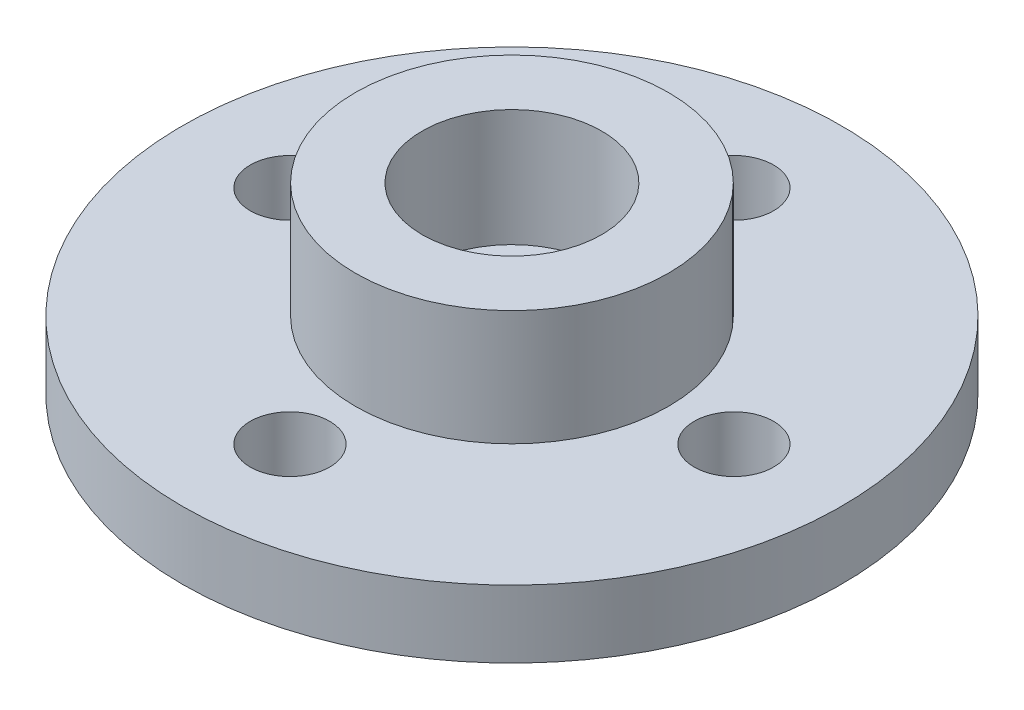
ISO-10303-21;
HEADER;
FILE_DESCRIPTION(('STEP AP214'),'2;1');
FILE_NAME('part.step','',(''),(''),'','','');
FILE_SCHEMA(('AUTOMOTIVE_DESIGN { 1 0 10303 214 1 1 1 1 }'));
ENDSEC;
DATA;
#1=APPLICATION_CONTEXT('core data for automotive mechanical design processes');
#2=APPLICATION_PROTOCOL_DEFINITION('international standard','automotive_design',2000,#1);
#3=PRODUCT_CONTEXT('',#1,'mechanical');
#4=PRODUCT('Part','Part','',(#3));
#5=PRODUCT_RELATED_PRODUCT_CATEGORY('part','',(#4));
#6=PRODUCT_DEFINITION_FORMATION('','',#4);
#7=PRODUCT_DEFINITION_CONTEXT('part definition',#1,'design');
#8=PRODUCT_DEFINITION('design','',#6,#7);
#9=PRODUCT_DEFINITION_SHAPE('','',#8);
#10=(LENGTH_UNIT() NAMED_UNIT(*) SI_UNIT(.MILLI.,.METRE.));
#11=(NAMED_UNIT(*) PLANE_ANGLE_UNIT() SI_UNIT($,.RADIAN.));
#12=(NAMED_UNIT(*) SI_UNIT($,.STERADIAN.) SOLID_ANGLE_UNIT());
#13=UNCERTAINTY_MEASURE_WITH_UNIT(LENGTH_MEASURE(1.E-05),#10,'distance_accuracy_value','');
#14=(GEOMETRIC_REPRESENTATION_CONTEXT(3) GLOBAL_UNCERTAINTY_ASSIGNED_CONTEXT((#13)) GLOBAL_UNIT_ASSIGNED_CONTEXT((#10,
#11,#12)) REPRESENTATION_CONTEXT('',''));
#15=CARTESIAN_POINT('',(0.,0.,0.));
#16=DIRECTION('',(0.,0.,1.));
#17=DIRECTION('',(1.,0.,0.));
#18=AXIS2_PLACEMENT_3D('',#15,#16,#17);
#19=CARTESIAN_POINT('',(0.,2.05,0.));
#20=DIRECTION('',(0.,-1.,0.));
#21=DIRECTION('',(0.,0.,-1.));
#22=AXIS2_PLACEMENT_3D('',#19,#20,#21);
#23=CYLINDRICAL_SURFACE('',#22,10.);
#24=CARTESIAN_POINT('',(0.,2.05,0.));
#25=DIRECTION('',(0.,1.,0.));
#26=DIRECTION('',(0.,0.,1.));
#27=AXIS2_PLACEMENT_3D('',#24,#25,#26);
#28=CIRCLE('',#27,10.);
#29=CARTESIAN_POINT('',(0.,2.05,10.));
#30=VERTEX_POINT('',#29);
#31=EDGE_CURVE('E10',#30,#30,#28,.T.);
#32=ORIENTED_EDGE('',*,*,#31,.F.);
#33=EDGE_LOOP('',(#32));
#34=FACE_BOUND('',#33,.T.);
#35=CARTESIAN_POINT('',(0.,0.,0.));
#36=DIRECTION('',(0.,1.,0.));
#37=DIRECTION('',(0.,0.,1.));
#38=AXIS2_PLACEMENT_3D('',#35,#36,#37);
#39=CIRCLE('',#38,10.);
#40=CARTESIAN_POINT('',(0.,0.,10.));
#41=VERTEX_POINT('',#40);
#42=EDGE_CURVE('E33',#41,#41,#39,.T.);
#43=ORIENTED_EDGE('',*,*,#42,.T.);
#44=EDGE_LOOP('',(#43));
#45=FACE_BOUND('',#44,.T.);
#46=ADVANCED_FACE('F30',(#34,#45),#23,.T.);
#47=CARTESIAN_POINT('',(0.,2.05,0.));
#48=DIRECTION('',(0.,1.,0.));
#49=DIRECTION('',(0.,0.,1.));
#50=AXIS2_PLACEMENT_3D('',#47,#48,#49);
#51=PLANE('',#50);
#52=CARTESIAN_POINT('',(6.735,2.05,0.));
#53=DIRECTION('',(0.,1.,0.));
#54=DIRECTION('',(0.,0.,1.));
#55=AXIS2_PLACEMENT_3D('',#52,#53,#54);
#56=CIRCLE('',#55,1.205);
#57=CARTESIAN_POINT('',(6.735,2.05,1.205));
#58=VERTEX_POINT('',#57);
#59=EDGE_CURVE('E71',#58,#58,#56,.T.);
#60=ORIENTED_EDGE('',*,*,#59,.F.);
#61=EDGE_LOOP('',(#60));
#62=FACE_BOUND('',#61,.T.);
#63=CARTESIAN_POINT('',(0.,2.05,-6.735));
#64=DIRECTION('',(0.,1.,0.));
#65=DIRECTION('',(0.,0.,1.));
#66=AXIS2_PLACEMENT_3D('',#63,#64,#65);
#67=CIRCLE('',#66,1.205);
#68=CARTESIAN_POINT('',(0.,2.05,-5.53));
#69=VERTEX_POINT('',#68);
#70=EDGE_CURVE('E74',#69,#69,#67,.T.);
#71=ORIENTED_EDGE('',*,*,#70,.F.);
#72=EDGE_LOOP('',(#71));
#73=FACE_BOUND('',#72,.T.);
#74=CARTESIAN_POINT('',(0.,2.05,6.735));
#75=DIRECTION('',(0.,1.,0.));
#76=DIRECTION('',(0.,0.,1.));
#77=AXIS2_PLACEMENT_3D('',#74,#75,#76);
#78=CIRCLE('',#77,1.205);
#79=CARTESIAN_POINT('',(0.,2.05,7.94));
#80=VERTEX_POINT('',#79);
#81=EDGE_CURVE('E65',#80,#80,#78,.T.);
#82=ORIENTED_EDGE('',*,*,#81,.F.);
#83=EDGE_LOOP('',(#82));
#84=FACE_BOUND('',#83,.T.);
#85=CARTESIAN_POINT('',(-6.735,2.05,0.));
#86=DIRECTION('',(0.,1.,0.));
#87=DIRECTION('',(0.,0.,1.));
#88=AXIS2_PLACEMENT_3D('',#85,#86,#87);
#89=CIRCLE('',#88,1.205);
#90=CARTESIAN_POINT('',(-6.735,2.05,1.205));
#91=VERTEX_POINT('',#90);
#92=EDGE_CURVE('E59',#91,#91,#89,.T.);
#93=ORIENTED_EDGE('',*,*,#92,.F.);
#94=EDGE_LOOP('',(#93));
#95=FACE_BOUND('',#94,.T.);
#96=CARTESIAN_POINT('',(0.,2.05,0.));
#97=DIRECTION('',(0.,1.,0.));
#98=DIRECTION('',(0.,0.,1.));
#99=AXIS2_PLACEMENT_3D('',#96,#97,#98);
#100=CIRCLE('',#99,4.75);
#101=CARTESIAN_POINT('',(0.,2.05,4.75));
#102=VERTEX_POINT('',#101);
#103=EDGE_CURVE('E42',#102,#102,#100,.T.);
#104=ORIENTED_EDGE('',*,*,#103,.F.);
#105=EDGE_LOOP('',(#104));
#106=FACE_BOUND('',#105,.T.);
#107=ORIENTED_EDGE('',*,*,#31,.T.);
#108=EDGE_LOOP('',(#107));
#109=FACE_BOUND('',#108,.T.);
#110=ADVANCED_FACE('F90',(#62,#73,#84,#95,#106,#109),#51,.T.);
#111=CARTESIAN_POINT('',(0.,0.,0.));
#112=DIRECTION('',(0.,1.,0.));
#113=DIRECTION('',(0.,0.,1.));
#114=AXIS2_PLACEMENT_3D('',#111,#112,#113);
#115=PLANE('',#114);
#116=CARTESIAN_POINT('',(6.735,0.,0.));
#117=DIRECTION('',(0.,-1.,0.));
#118=DIRECTION('',(0.,0.,1.));
#119=AXIS2_PLACEMENT_3D('',#116,#117,#118);
#120=CIRCLE('',#119,1.205);
#121=CARTESIAN_POINT('',(6.735,0.,1.205));
#122=VERTEX_POINT('',#121);
#123=EDGE_CURVE('E77',#122,#122,#120,.T.);
#124=ORIENTED_EDGE('',*,*,#123,.F.);
#125=EDGE_LOOP('',(#124));
#126=FACE_BOUND('',#125,.T.);
#127=CARTESIAN_POINT('',(0.,0.,-6.735));
#128=DIRECTION('',(0.,-1.,0.));
#129=DIRECTION('',(1.,0.,0.));
#130=AXIS2_PLACEMENT_3D('',#127,#128,#129);
#131=CIRCLE('',#130,1.205);
#132=CARTESIAN_POINT('',(1.20499999999993,0.,-6.73500000000001));
#133=VERTEX_POINT('',#132);
#134=EDGE_CURVE('E78',#133,#133,#131,.T.);
#135=ORIENTED_EDGE('',*,*,#134,.F.);
#136=EDGE_LOOP('',(#135));
#137=FACE_BOUND('',#136,.T.);
#138=CARTESIAN_POINT('',(0.,0.,6.735));
#139=DIRECTION('',(0.,-1.,0.));
#140=DIRECTION('',(-1.,0.,0.));
#141=AXIS2_PLACEMENT_3D('',#138,#139,#140);
#142=CIRCLE('',#141,1.205);
#143=CARTESIAN_POINT('',(-1.20499999999998,0.,6.735));
#144=VERTEX_POINT('',#143);
#145=EDGE_CURVE('E68',#144,#144,#142,.T.);
#146=ORIENTED_EDGE('',*,*,#145,.F.);
#147=EDGE_LOOP('',(#146));
#148=FACE_BOUND('',#147,.T.);
#149=CARTESIAN_POINT('',(-6.735,0.,0.));
#150=DIRECTION('',(0.,-1.,0.));
#151=DIRECTION('',(0.,0.,-1.));
#152=AXIS2_PLACEMENT_3D('',#149,#150,#151);
#153=CIRCLE('',#152,1.205);
#154=CARTESIAN_POINT('',(-6.735,0.,-1.205));
#155=VERTEX_POINT('',#154);
#156=EDGE_CURVE('E62',#155,#155,#153,.T.);
#157=ORIENTED_EDGE('',*,*,#156,.F.);
#158=EDGE_LOOP('',(#157));
#159=FACE_BOUND('',#158,.T.);
#160=CARTESIAN_POINT('',(0.,0.,0.));
#161=DIRECTION('',(0.,1.,0.));
#162=DIRECTION('',(0.,0.,1.));
#163=AXIS2_PLACEMENT_3D('',#160,#161,#162);
#164=CIRCLE('',#163,1.375);
#165=CARTESIAN_POINT('',(0.,0.,1.375));
#166=VERTEX_POINT('',#165);
#167=EDGE_CURVE('E51',#166,#166,#164,.T.);
#168=ORIENTED_EDGE('',*,*,#167,.T.);
#169=EDGE_LOOP('',(#168));
#170=FACE_BOUND('',#169,.T.);
#171=ORIENTED_EDGE('',*,*,#42,.F.);
#172=EDGE_LOOP('',(#171));
#173=FACE_BOUND('',#172,.T.);
#174=ADVANCED_FACE('F86',(#126,#137,#148,#159,#170,#173),#115,.F.);
#175=CARTESIAN_POINT('',(0.,5.55,0.));
#176=DIRECTION('',(0.,-1.,0.));
#177=DIRECTION('',(0.,0.,-1.));
#178=AXIS2_PLACEMENT_3D('',#175,#176,#177);
#179=CYLINDRICAL_SURFACE('',#178,4.75);
#180=CARTESIAN_POINT('',(0.,5.55,0.));
#181=DIRECTION('',(0.,1.,0.));
#182=DIRECTION('',(0.,0.,1.));
#183=AXIS2_PLACEMENT_3D('',#180,#181,#182);
#184=CIRCLE('',#183,4.75);
#185=CARTESIAN_POINT('',(0.,5.55,4.75));
#186=VERTEX_POINT('',#185);
#187=EDGE_CURVE('E40',#186,#186,#184,.T.);
#188=ORIENTED_EDGE('',*,*,#187,.F.);
#189=EDGE_LOOP('',(#188));
#190=FACE_BOUND('',#189,.T.);
#191=ORIENTED_EDGE('',*,*,#103,.T.);
#192=EDGE_LOOP('',(#191));
#193=FACE_BOUND('',#192,.T.);
#194=ADVANCED_FACE('F89',(#190,#193),#179,.T.);
#195=CARTESIAN_POINT('',(0.,5.55,0.));
#196=DIRECTION('',(0.,1.,0.));
#197=DIRECTION('',(0.,0.,1.));
#198=AXIS2_PLACEMENT_3D('',#195,#196,#197);
#199=PLANE('',#198);
#200=CARTESIAN_POINT('',(0.,5.55,0.));
#201=DIRECTION('',(0.,1.,0.));
#202=DIRECTION('',(0.,0.,1.));
#203=AXIS2_PLACEMENT_3D('',#200,#201,#202);
#204=CIRCLE('',#203,2.725);
#205=CARTESIAN_POINT('',(0.,5.55,2.725));
#206=VERTEX_POINT('',#205);
#207=EDGE_CURVE('E48',#206,#206,#204,.T.);
#208=ORIENTED_EDGE('',*,*,#207,.F.);
#209=EDGE_LOOP('',(#208));
#210=FACE_BOUND('',#209,.T.);
#211=ORIENTED_EDGE('',*,*,#187,.T.);
#212=EDGE_LOOP('',(#211));
#213=FACE_BOUND('',#212,.T.);
#214=ADVANCED_FACE('F115',(#210,#213),#199,.T.);
#215=CARTESIAN_POINT('',(0.,2.,0.));
#216=DIRECTION('',(0.,1.,0.));
#217=DIRECTION('',(0.,0.,1.));
#218=AXIS2_PLACEMENT_3D('',#215,#216,#217);
#219=CYLINDRICAL_SURFACE('',#218,2.725);
#220=CARTESIAN_POINT('',(0.,2.,0.));
#221=DIRECTION('',(0.,1.,0.));
#222=DIRECTION('',(0.,0.,1.));
#223=AXIS2_PLACEMENT_3D('',#220,#221,#222);
#224=CIRCLE('',#223,2.725);
#225=CARTESIAN_POINT('',(0.,2.,2.725));
#226=VERTEX_POINT('',#225);
#227=EDGE_CURVE('E45',#226,#226,#224,.T.);
#228=ORIENTED_EDGE('',*,*,#227,.F.);
#229=EDGE_LOOP('',(#228));
#230=FACE_BOUND('',#229,.T.);
#231=ORIENTED_EDGE('',*,*,#207,.T.);
#232=EDGE_LOOP('',(#231));
#233=FACE_BOUND('',#232,.T.);
#234=ADVANCED_FACE('F119',(#230,#233),#219,.F.);
#235=CARTESIAN_POINT('',(0.,2.,0.));
#236=DIRECTION('',(0.,1.,0.));
#237=DIRECTION('',(0.,0.,1.));
#238=AXIS2_PLACEMENT_3D('',#235,#236,#237);
#239=PLANE('',#238);
#240=CARTESIAN_POINT('',(0.,2.,0.));
#241=DIRECTION('',(0.,1.,0.));
#242=DIRECTION('',(0.,0.,1.));
#243=AXIS2_PLACEMENT_3D('',#240,#241,#242);
#244=CIRCLE('',#243,1.375);
#245=CARTESIAN_POINT('',(0.,2.,1.375));
#246=VERTEX_POINT('',#245);
#247=EDGE_CURVE('E56',#246,#246,#244,.T.);
#248=ORIENTED_EDGE('',*,*,#247,.F.);
#249=EDGE_LOOP('',(#248));
#250=FACE_BOUND('',#249,.T.);
#251=ORIENTED_EDGE('',*,*,#227,.T.);
#252=EDGE_LOOP('',(#251));
#253=FACE_BOUND('',#252,.T.);
#254=ADVANCED_FACE('F123',(#250,#253),#239,.T.);
#255=CARTESIAN_POINT('',(0.,-1.55,0.));
#256=DIRECTION('',(0.,1.,0.));
#257=DIRECTION('',(0.,0.,1.));
#258=AXIS2_PLACEMENT_3D('',#255,#256,#257);
#259=CYLINDRICAL_SURFACE('',#258,1.375);
#260=ORIENTED_EDGE('',*,*,#247,.T.);
#261=EDGE_LOOP('',(#260));
#262=FACE_BOUND('',#261,.T.);
#263=ORIENTED_EDGE('',*,*,#167,.F.);
#264=EDGE_LOOP('',(#263));
#265=FACE_BOUND('',#264,.T.);
#266=ADVANCED_FACE('F127',(#262,#265),#259,.F.);
#267=CARTESIAN_POINT('',(-6.735,3.55,0.));
#268=DIRECTION('',(0.,-1.,0.));
#269=DIRECTION('',(0.,0.,-1.));
#270=AXIS2_PLACEMENT_3D('',#267,#268,#269);
#271=CYLINDRICAL_SURFACE('',#270,1.205);
#272=ORIENTED_EDGE('',*,*,#92,.T.);
#273=EDGE_LOOP('',(#272));
#274=FACE_BOUND('',#273,.T.);
#275=ORIENTED_EDGE('',*,*,#156,.T.);
#276=EDGE_LOOP('',(#275));
#277=FACE_BOUND('',#276,.T.);
#278=ADVANCED_FACE('F131',(#274,#277),#271,.F.);
#279=CARTESIAN_POINT('',(0.,3.55,6.735));
#280=DIRECTION('',(0.,-1.,0.));
#281=DIRECTION('',(0.,0.,-1.));
#282=AXIS2_PLACEMENT_3D('',#279,#280,#281);
#283=CYLINDRICAL_SURFACE('',#282,1.205);
#284=ORIENTED_EDGE('',*,*,#81,.T.);
#285=EDGE_LOOP('',(#284));
#286=FACE_BOUND('',#285,.T.);
#287=ORIENTED_EDGE('',*,*,#145,.T.);
#288=EDGE_LOOP('',(#287));
#289=FACE_BOUND('',#288,.T.);
#290=ADVANCED_FACE('F135',(#286,#289),#283,.F.);
#291=CARTESIAN_POINT('',(0.,3.55,-6.735));
#292=DIRECTION('',(0.,-1.,0.));
#293=DIRECTION('',(0.,0.,-1.));
#294=AXIS2_PLACEMENT_3D('',#291,#292,#293);
#295=CYLINDRICAL_SURFACE('',#294,1.205);
#296=ORIENTED_EDGE('',*,*,#70,.T.);
#297=EDGE_LOOP('',(#296));
#298=FACE_BOUND('',#297,.T.);
#299=ORIENTED_EDGE('',*,*,#134,.T.);
#300=EDGE_LOOP('',(#299));
#301=FACE_BOUND('',#300,.T.);
#302=ADVANCED_FACE('F139',(#298,#301),#295,.F.);
#303=CARTESIAN_POINT('',(6.735,3.55,0.));
#304=DIRECTION('',(0.,-1.,0.));
#305=DIRECTION('',(0.,0.,-1.));
#306=AXIS2_PLACEMENT_3D('',#303,#304,#305);
#307=CYLINDRICAL_SURFACE('',#306,1.205);
#308=ORIENTED_EDGE('',*,*,#59,.T.);
#309=EDGE_LOOP('',(#308));
#310=FACE_BOUND('',#309,.T.);
#311=ORIENTED_EDGE('',*,*,#123,.T.);
#312=EDGE_LOOP('',(#311));
#313=FACE_BOUND('',#312,.T.);
#314=ADVANCED_FACE('F84',(#310,#313),#307,.F.);
#315=CLOSED_SHELL('',(#46,#110,#174,#194,#214,#234,#254,#266,#278,#290,#302,#314));
#316=MANIFOLD_SOLID_BREP('B2',#315);
#317=ADVANCED_BREP_SHAPE_REPRESENTATION('',(#18,#316),#14);
#318=SHAPE_DEFINITION_REPRESENTATION(#9,#317);
ENDSEC;
END-ISO-10303-21;
